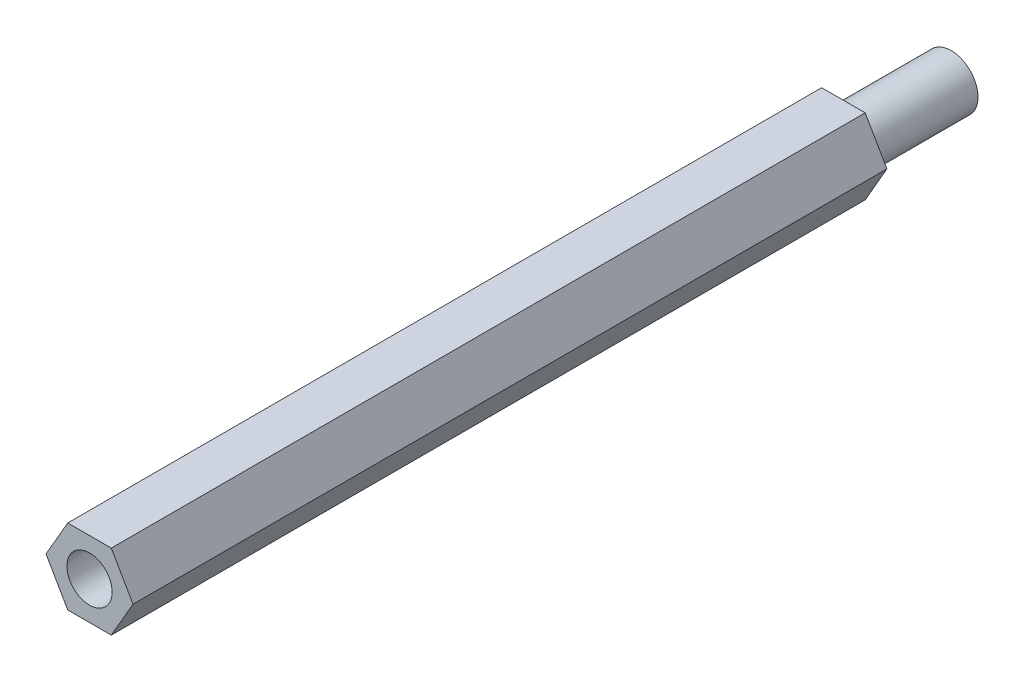
ISO-10303-21;
HEADER;
FILE_DESCRIPTION(('STEP AP214'),'2;1');
FILE_NAME('part.step','',(''),(''),'','','');
FILE_SCHEMA(('AUTOMOTIVE_DESIGN { 1 0 10303 214 1 1 1 1 }'));
ENDSEC;
DATA;
#1=APPLICATION_CONTEXT('core data for automotive mechanical design processes');
#2=APPLICATION_PROTOCOL_DEFINITION('international standard','automotive_design',2000,#1);
#3=PRODUCT_CONTEXT('',#1,'mechanical');
#4=PRODUCT('Part','Part','',(#3));
#5=PRODUCT_RELATED_PRODUCT_CATEGORY('part','',(#4));
#6=PRODUCT_DEFINITION_FORMATION('','',#4);
#7=PRODUCT_DEFINITION_CONTEXT('part definition',#1,'design');
#8=PRODUCT_DEFINITION('design','',#6,#7);
#9=PRODUCT_DEFINITION_SHAPE('','',#8);
#10=(LENGTH_UNIT() NAMED_UNIT(*) SI_UNIT(.MILLI.,.METRE.));
#11=(NAMED_UNIT(*) PLANE_ANGLE_UNIT() SI_UNIT($,.RADIAN.));
#12=(NAMED_UNIT(*) SI_UNIT($,.STERADIAN.) SOLID_ANGLE_UNIT());
#13=UNCERTAINTY_MEASURE_WITH_UNIT(LENGTH_MEASURE(1.E-05),#10,'distance_accuracy_value','');
#14=(GEOMETRIC_REPRESENTATION_CONTEXT(3) GLOBAL_UNCERTAINTY_ASSIGNED_CONTEXT((#13)) GLOBAL_UNIT_ASSIGNED_CONTEXT((#10,
#11,#12)) REPRESENTATION_CONTEXT('',''));
#15=CARTESIAN_POINT('',(0.,0.,0.));
#16=DIRECTION('',(0.,0.,1.));
#17=DIRECTION('',(1.,0.,0.));
#18=AXIS2_PLACEMENT_3D('',#15,#16,#17);
#19=CARTESIAN_POINT('',(2.02072594216369,3.5,70.));
#20=DIRECTION('',(0.,-1.,0.));
#21=DIRECTION('',(1.,0.,0.));
#22=AXIS2_PLACEMENT_3D('',#19,#20,#21);
#23=PLANE('',#22);
#24=DIRECTION('',(-1.,0.,0.));
#25=VECTOR('',#24,1.);
#26=CARTESIAN_POINT('',(2.02072594216369,3.5,0.));
#27=LINE('',#26,#25);
#28=CARTESIAN_POINT('',(2.02072594216369,3.5,0.));
#29=VERTEX_POINT('',#28);
#30=CARTESIAN_POINT('',(-2.02072594216369,3.5,0.));
#31=VERTEX_POINT('',#30);
#32=EDGE_CURVE('E134',#29,#31,#27,.T.);
#33=ORIENTED_EDGE('',*,*,#32,.T.);
#34=DIRECTION('',(0.,0.,-1.));
#35=VECTOR('',#34,1.);
#36=CARTESIAN_POINT('',(-2.02072594216369,3.5,70.));
#37=LINE('',#36,#35);
#38=CARTESIAN_POINT('',(-2.02072594216369,3.5,70.));
#39=VERTEX_POINT('',#38);
#40=EDGE_CURVE('E44',#39,#31,#37,.T.);
#41=ORIENTED_EDGE('',*,*,#40,.F.);
#42=DIRECTION('',(-1.,0.,0.));
#43=VECTOR('',#42,1.);
#44=CARTESIAN_POINT('',(2.02072594216369,3.5,70.));
#45=LINE('',#44,#43);
#46=CARTESIAN_POINT('',(2.02072594216369,3.5,70.));
#47=VERTEX_POINT('',#46);
#48=EDGE_CURVE('E151',#47,#39,#45,.T.);
#49=ORIENTED_EDGE('',*,*,#48,.F.);
#50=DIRECTION('',(0.,0.,-1.));
#51=VECTOR('',#50,1.);
#52=CARTESIAN_POINT('',(2.02072594216369,3.5,70.));
#53=LINE('',#52,#51);
#54=EDGE_CURVE('E130',#47,#29,#53,.T.);
#55=ORIENTED_EDGE('',*,*,#54,.T.);
#56=EDGE_LOOP('',(#33,#41,#49,#55));
#57=FACE_BOUND('',#56,.T.);
#58=ADVANCED_FACE('F41',(#57),#23,.F.);
#59=CARTESIAN_POINT('',(-2.02072594216369,3.5,70.));
#60=DIRECTION('',(0.866025403784439,-0.5,0.));
#61=DIRECTION('',(0.5,0.866025403784439,0.));
#62=AXIS2_PLACEMENT_3D('',#59,#60,#61);
#63=PLANE('',#62);
#64=DIRECTION('',(-0.5,-0.866025403784439,0.));
#65=VECTOR('',#64,1.);
#66=CARTESIAN_POINT('',(-2.02072594216369,3.5,0.));
#67=LINE('',#66,#65);
#68=CARTESIAN_POINT('',(-4.04145188432738,0.,0.));
#69=VERTEX_POINT('',#68);
#70=EDGE_CURVE('E138',#31,#69,#67,.T.);
#71=ORIENTED_EDGE('',*,*,#70,.T.);
#72=DIRECTION('',(0.,0.,-1.));
#73=VECTOR('',#72,1.);
#74=CARTESIAN_POINT('',(-4.04145188432738,0.,70.));
#75=LINE('',#74,#73);
#76=CARTESIAN_POINT('',(-4.04145188432738,0.,70.));
#77=VERTEX_POINT('',#76);
#78=EDGE_CURVE('E157',#77,#69,#75,.T.);
#79=ORIENTED_EDGE('',*,*,#78,.F.);
#80=DIRECTION('',(-0.5,-0.866025403784439,0.));
#81=VECTOR('',#80,1.);
#82=CARTESIAN_POINT('',(-2.02072594216369,3.5,70.));
#83=LINE('',#82,#81);
#84=EDGE_CURVE('E98',#39,#77,#83,.T.);
#85=ORIENTED_EDGE('',*,*,#84,.F.);
#86=ORIENTED_EDGE('',*,*,#40,.T.);
#87=EDGE_LOOP('',(#71,#79,#85,#86));
#88=FACE_BOUND('',#87,.T.);
#89=ADVANCED_FACE('F164',(#88),#63,.F.);
#90=CARTESIAN_POINT('',(-4.04145188432738,0.,70.));
#91=DIRECTION('',(0.866025403784439,0.5,0.));
#92=DIRECTION('',(-0.5,0.866025403784439,0.));
#93=AXIS2_PLACEMENT_3D('',#90,#91,#92);
#94=PLANE('',#93);
#95=DIRECTION('',(0.5,-0.866025403784439,0.));
#96=VECTOR('',#95,1.);
#97=CARTESIAN_POINT('',(-4.04145188432738,0.,0.));
#98=LINE('',#97,#96);
#99=CARTESIAN_POINT('',(-2.02072594216369,-3.5,0.));
#100=VERTEX_POINT('',#99);
#101=EDGE_CURVE('E142',#69,#100,#98,.T.);
#102=ORIENTED_EDGE('',*,*,#101,.T.);
#103=DIRECTION('',(0.,0.,-1.));
#104=VECTOR('',#103,1.);
#105=CARTESIAN_POINT('',(-2.02072594216369,-3.5,70.));
#106=LINE('',#105,#104);
#107=CARTESIAN_POINT('',(-2.02072594216369,-3.5,70.));
#108=VERTEX_POINT('',#107);
#109=EDGE_CURVE('E123',#108,#100,#106,.T.);
#110=ORIENTED_EDGE('',*,*,#109,.F.);
#111=DIRECTION('',(0.5,-0.866025403784439,0.));
#112=VECTOR('',#111,1.);
#113=CARTESIAN_POINT('',(-4.04145188432738,0.,70.));
#114=LINE('',#113,#112);
#115=EDGE_CURVE('E112',#77,#108,#114,.T.);
#116=ORIENTED_EDGE('',*,*,#115,.F.);
#117=ORIENTED_EDGE('',*,*,#78,.T.);
#118=EDGE_LOOP('',(#102,#110,#116,#117));
#119=FACE_BOUND('',#118,.T.);
#120=ADVANCED_FACE('F170',(#119),#94,.F.);
#121=CARTESIAN_POINT('',(-2.02072594216369,-3.5,70.));
#122=DIRECTION('',(0.,1.,0.));
#123=DIRECTION('',(-1.,0.,0.));
#124=AXIS2_PLACEMENT_3D('',#121,#122,#123);
#125=PLANE('',#124);
#126=DIRECTION('',(1.,0.,0.));
#127=VECTOR('',#126,1.);
#128=CARTESIAN_POINT('',(-2.02072594216369,-3.5,0.));
#129=LINE('',#128,#127);
#130=CARTESIAN_POINT('',(2.02072594216369,-3.5,0.));
#131=VERTEX_POINT('',#130);
#132=EDGE_CURVE('E121',#100,#131,#129,.T.);
#133=ORIENTED_EDGE('',*,*,#132,.T.);
#134=DIRECTION('',(0.,0.,-1.));
#135=VECTOR('',#134,1.);
#136=CARTESIAN_POINT('',(2.02072594216369,-3.5,70.));
#137=LINE('',#136,#135);
#138=CARTESIAN_POINT('',(2.02072594216369,-3.5,70.));
#139=VERTEX_POINT('',#138);
#140=EDGE_CURVE('E118',#139,#131,#137,.T.);
#141=ORIENTED_EDGE('',*,*,#140,.F.);
#142=DIRECTION('',(1.,0.,0.));
#143=VECTOR('',#142,1.);
#144=CARTESIAN_POINT('',(-2.02072594216369,-3.5,70.));
#145=LINE('',#144,#143);
#146=EDGE_CURVE('E106',#108,#139,#145,.T.);
#147=ORIENTED_EDGE('',*,*,#146,.F.);
#148=ORIENTED_EDGE('',*,*,#109,.T.);
#149=EDGE_LOOP('',(#133,#141,#147,#148));
#150=FACE_BOUND('',#149,.T.);
#151=ADVANCED_FACE('F119',(#150),#125,.F.);
#152=CARTESIAN_POINT('',(2.02072594216369,-3.5,70.));
#153=DIRECTION('',(-0.866025403784439,0.5,0.));
#154=DIRECTION('',(-0.5,-0.866025403784439,0.));
#155=AXIS2_PLACEMENT_3D('',#152,#153,#154);
#156=PLANE('',#155);
#157=DIRECTION('',(0.5,0.866025403784439,0.));
#158=VECTOR('',#157,1.);
#159=CARTESIAN_POINT('',(2.02072594216369,-3.5,0.));
#160=LINE('',#159,#158);
#161=CARTESIAN_POINT('',(4.04145188432738,0.,0.));
#162=VERTEX_POINT('',#161);
#163=EDGE_CURVE('E83',#131,#162,#160,.T.);
#164=ORIENTED_EDGE('',*,*,#163,.T.);
#165=DIRECTION('',(0.,0.,-1.));
#166=VECTOR('',#165,1.);
#167=CARTESIAN_POINT('',(4.04145188432738,0.,70.));
#168=LINE('',#167,#166);
#169=CARTESIAN_POINT('',(4.04145188432738,0.,70.));
#170=VERTEX_POINT('',#169);
#171=EDGE_CURVE('E124',#170,#162,#168,.T.);
#172=ORIENTED_EDGE('',*,*,#171,.F.);
#173=DIRECTION('',(0.5,0.866025403784439,0.));
#174=VECTOR('',#173,1.);
#175=CARTESIAN_POINT('',(2.02072594216369,-3.5,70.));
#176=LINE('',#175,#174);
#177=EDGE_CURVE('E110',#139,#170,#176,.T.);
#178=ORIENTED_EDGE('',*,*,#177,.F.);
#179=ORIENTED_EDGE('',*,*,#140,.T.);
#180=EDGE_LOOP('',(#164,#172,#178,#179));
#181=FACE_BOUND('',#180,.T.);
#182=ADVANCED_FACE('F126',(#181),#156,.F.);
#183=CARTESIAN_POINT('',(4.04145188432738,0.,70.));
#184=DIRECTION('',(-0.866025403784439,-0.5,0.));
#185=DIRECTION('',(0.5,-0.866025403784439,0.));
#186=AXIS2_PLACEMENT_3D('',#183,#184,#185);
#187=PLANE('',#186);
#188=DIRECTION('',(-0.5,0.866025403784438,0.));
#189=VECTOR('',#188,1.);
#190=CARTESIAN_POINT('',(4.04145188432738,0.,0.));
#191=LINE('',#190,#189);
#192=EDGE_CURVE('E89',#162,#29,#191,.T.);
#193=ORIENTED_EDGE('',*,*,#192,.T.);
#194=ORIENTED_EDGE('',*,*,#54,.F.);
#195=DIRECTION('',(-0.5,0.866025403784438,0.));
#196=VECTOR('',#195,1.);
#197=CARTESIAN_POINT('',(4.04145188432738,0.,70.));
#198=LINE('',#197,#196);
#199=EDGE_CURVE('E59',#170,#47,#198,.T.);
#200=ORIENTED_EDGE('',*,*,#199,.F.);
#201=ORIENTED_EDGE('',*,*,#171,.T.);
#202=EDGE_LOOP('',(#193,#194,#200,#201));
#203=FACE_BOUND('',#202,.T.);
#204=ADVANCED_FACE('F192',(#203),#187,.F.);
#205=CARTESIAN_POINT('',(0.,0.,70.));
#206=DIRECTION('',(0.,0.,1.));
#207=DIRECTION('',(1.,0.,0.));
#208=AXIS2_PLACEMENT_3D('',#205,#206,#207);
#209=PLANE('',#208);
#210=CARTESIAN_POINT('',(0.,0.,70.));
#211=DIRECTION('',(0.,0.,1.));
#212=DIRECTION('',(1.,0.,0.));
#213=AXIS2_PLACEMENT_3D('',#210,#211,#212);
#214=CIRCLE('',#213,2.1);
#215=CARTESIAN_POINT('',(2.1,0.,70.));
#216=VERTEX_POINT('',#215);
#217=EDGE_CURVE('E184',#216,#216,#214,.T.);
#218=ORIENTED_EDGE('',*,*,#217,.F.);
#219=EDGE_LOOP('',(#218));
#220=FACE_BOUND('',#219,.T.);
#221=ORIENTED_EDGE('',*,*,#48,.T.);
#222=ORIENTED_EDGE('',*,*,#84,.T.);
#223=ORIENTED_EDGE('',*,*,#115,.T.);
#224=ORIENTED_EDGE('',*,*,#146,.T.);
#225=ORIENTED_EDGE('',*,*,#177,.T.);
#226=ORIENTED_EDGE('',*,*,#199,.T.);
#227=EDGE_LOOP('',(#221,#222,#223,#224,#225,#226));
#228=FACE_BOUND('',#227,.T.);
#229=ADVANCED_FACE('F108',(#220,#228),#209,.T.);
#230=CARTESIAN_POINT('',(0.,0.,0.));
#231=DIRECTION('',(0.,0.,1.));
#232=DIRECTION('',(1.,0.,0.));
#233=AXIS2_PLACEMENT_3D('',#230,#231,#232);
#234=PLANE('',#233);
#235=CARTESIAN_POINT('',(0.,0.,0.));
#236=DIRECTION('',(0.,0.,-1.));
#237=DIRECTION('',(-1.,0.,0.));
#238=AXIS2_PLACEMENT_3D('',#235,#236,#237);
#239=CIRCLE('',#238,2.5);
#240=CARTESIAN_POINT('',(-2.5,0.,0.));
#241=VERTEX_POINT('',#240);
#242=EDGE_CURVE('E11',#241,#241,#239,.T.);
#243=ORIENTED_EDGE('',*,*,#242,.F.);
#244=EDGE_LOOP('',(#243));
#245=FACE_BOUND('',#244,.T.);
#246=ORIENTED_EDGE('',*,*,#32,.F.);
#247=ORIENTED_EDGE('',*,*,#192,.F.);
#248=ORIENTED_EDGE('',*,*,#163,.F.);
#249=ORIENTED_EDGE('',*,*,#132,.F.);
#250=ORIENTED_EDGE('',*,*,#101,.F.);
#251=ORIENTED_EDGE('',*,*,#70,.F.);
#252=EDGE_LOOP('',(#246,#247,#248,#249,#250,#251));
#253=FACE_BOUND('',#252,.T.);
#254=ADVANCED_FACE('F169',(#245,#253),#234,.F.);
#255=CARTESIAN_POINT('',(0.,0.,-10.));
#256=DIRECTION('',(0.,0.,1.));
#257=DIRECTION('',(1.,0.,0.));
#258=AXIS2_PLACEMENT_3D('',#255,#256,#257);
#259=CYLINDRICAL_SURFACE('',#258,2.5);
#260=CARTESIAN_POINT('',(0.,0.,-10.));
#261=DIRECTION('',(0.,0.,-1.));
#262=DIRECTION('',(-1.,0.,0.));
#263=AXIS2_PLACEMENT_3D('',#260,#261,#262);
#264=CIRCLE('',#263,2.5);
#265=CARTESIAN_POINT('',(-2.5,0.,-10.));
#266=VERTEX_POINT('',#265);
#267=EDGE_CURVE('E139',#266,#266,#264,.T.);
#268=ORIENTED_EDGE('',*,*,#267,.F.);
#269=EDGE_LOOP('',(#268));
#270=FACE_BOUND('',#269,.T.);
#271=ORIENTED_EDGE('',*,*,#242,.T.);
#272=EDGE_LOOP('',(#271));
#273=FACE_BOUND('',#272,.T.);
#274=ADVANCED_FACE('F198',(#270,#273),#259,.T.);
#275=CARTESIAN_POINT('',(0.,0.,-10.));
#276=DIRECTION('',(0.,0.,-1.));
#277=DIRECTION('',(-1.,0.,0.));
#278=AXIS2_PLACEMENT_3D('',#275,#276,#277);
#279=PLANE('',#278);
#280=ORIENTED_EDGE('',*,*,#267,.T.);
#281=EDGE_LOOP('',(#280));
#282=FACE_BOUND('',#281,.T.);
#283=ADVANCED_FACE('F239',(#282),#279,.T.);
#284=CARTESIAN_POINT('',(0.,0.,57.6));
#285=DIRECTION('',(0.,0.,1.));
#286=DIRECTION('',(1.,0.,0.));
#287=AXIS2_PLACEMENT_3D('',#284,#285,#286);
#288=CONICAL_SURFACE('',#287,2.1,1.02974425867665);
#289=CARTESIAN_POINT('',(0.,0.,56.3381927000421));
#290=VERTEX_POINT('',#289);
#291=VERTEX_LOOP('',#290);
#292=FACE_BOUND('',#291,.T.);
#293=CARTESIAN_POINT('',(0.,0.,57.6));
#294=DIRECTION('',(0.,0.,1.));
#295=DIRECTION('',(1.,0.,0.));
#296=AXIS2_PLACEMENT_3D('',#293,#294,#295);
#297=CIRCLE('',#296,2.1);
#298=CARTESIAN_POINT('',(2.1,0.,57.6));
#299=VERTEX_POINT('',#298);
#300=EDGE_CURVE('E180',#299,#299,#297,.T.);
#301=ORIENTED_EDGE('',*,*,#300,.T.);
#302=EDGE_LOOP('',(#301));
#303=FACE_BOUND('',#302,.T.);
#304=ADVANCED_FACE('F247',(#292,#303),#288,.F.);
#305=CARTESIAN_POINT('',(0.,0.,70.));
#306=DIRECTION('',(0.,0.,1.));
#307=DIRECTION('',(1.,0.,0.));
#308=AXIS2_PLACEMENT_3D('',#305,#306,#307);
#309=CYLINDRICAL_SURFACE('',#308,2.1);
#310=ORIENTED_EDGE('',*,*,#300,.F.);
#311=EDGE_LOOP('',(#310));
#312=FACE_BOUND('',#311,.T.);
#313=ORIENTED_EDGE('',*,*,#217,.T.);
#314=EDGE_LOOP('',(#313));
#315=FACE_BOUND('',#314,.T.);
#316=ADVANCED_FACE('F189',(#312,#315),#309,.F.);
#317=CLOSED_SHELL('',(#58,#89,#120,#151,#182,#204,#229,#254,#274,#283,#304,#316));
#318=MANIFOLD_SOLID_BREP('B2',#317);
#319=ADVANCED_BREP_SHAPE_REPRESENTATION('',(#18,#318),#14);
#320=SHAPE_DEFINITION_REPRESENTATION(#9,#319);
ENDSEC;
END-ISO-10303-21;
